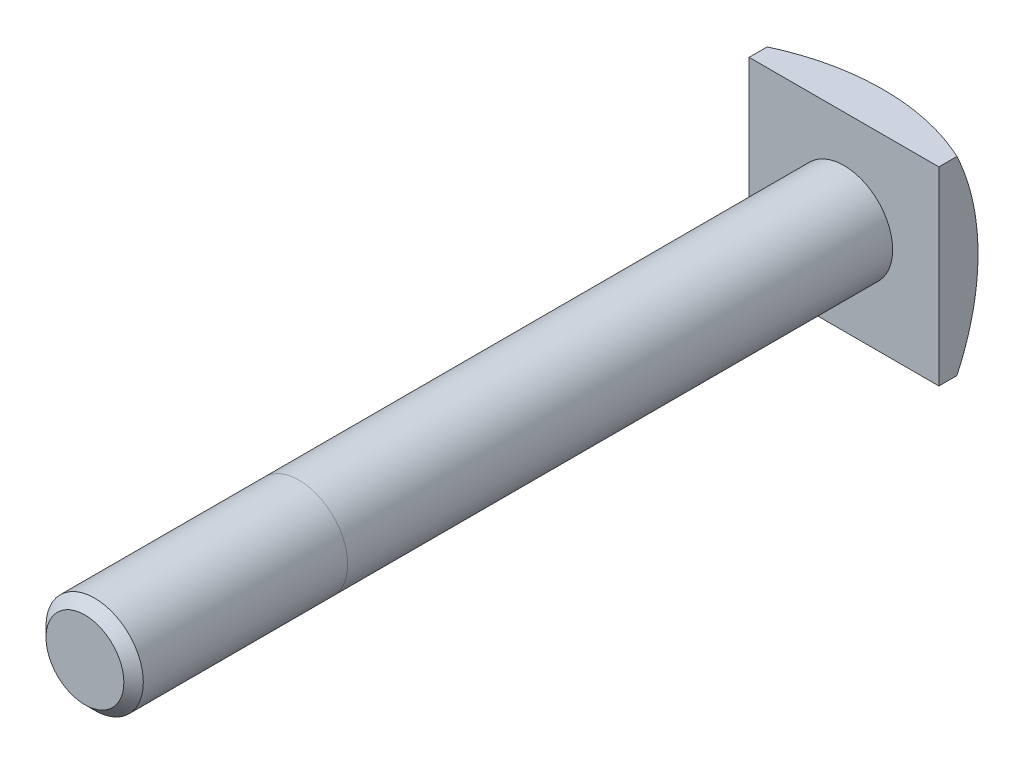
ISO-10303-21;
HEADER;
FILE_DESCRIPTION(('STEP AP214'),'2;1');
FILE_NAME('part.step','',(''),(''),'','','');
FILE_SCHEMA(('AUTOMOTIVE_DESIGN { 1 0 10303 214 1 1 1 1 }'));
ENDSEC;
DATA;
#1=APPLICATION_CONTEXT('core data for automotive mechanical design processes');
#2=APPLICATION_PROTOCOL_DEFINITION('international standard','automotive_design',2000,#1);
#3=PRODUCT_CONTEXT('',#1,'mechanical');
#4=PRODUCT('Part','Part','',(#3));
#5=PRODUCT_RELATED_PRODUCT_CATEGORY('part','',(#4));
#6=PRODUCT_DEFINITION_FORMATION('','',#4);
#7=PRODUCT_DEFINITION_CONTEXT('part definition',#1,'design');
#8=PRODUCT_DEFINITION('design','',#6,#7);
#9=PRODUCT_DEFINITION_SHAPE('','',#8);
#10=(LENGTH_UNIT() NAMED_UNIT(*) SI_UNIT(.MILLI.,.METRE.));
#11=(NAMED_UNIT(*) PLANE_ANGLE_UNIT() SI_UNIT($,.RADIAN.));
#12=(NAMED_UNIT(*) SI_UNIT($,.STERADIAN.) SOLID_ANGLE_UNIT());
#13=UNCERTAINTY_MEASURE_WITH_UNIT(LENGTH_MEASURE(1.E-05),#10,'distance_accuracy_value','');
#14=(GEOMETRIC_REPRESENTATION_CONTEXT(3) GLOBAL_UNCERTAINTY_ASSIGNED_CONTEXT((#13)) GLOBAL_UNIT_ASSIGNED_CONTEXT((#10,
#11,#12)) REPRESENTATION_CONTEXT('',''));
#15=CARTESIAN_POINT('',(0.,0.,0.));
#16=DIRECTION('',(0.,0.,1.));
#17=DIRECTION('',(1.,0.,0.));
#18=AXIS2_PLACEMENT_3D('',#15,#16,#17);
#19=CARTESIAN_POINT('',(0.,0.,84.));
#20=DIRECTION('',(0.,0.,-1.));
#21=DIRECTION('',(-1.,0.,0.));
#22=AXIS2_PLACEMENT_3D('',#19,#20,#21);
#23=CYLINDRICAL_SURFACE('',#22,5.);
#24=CARTESIAN_POINT('',(0.,0.,83.));
#25=DIRECTION('',(0.,0.,1.));
#26=DIRECTION('',(1.,0.,0.));
#27=AXIS2_PLACEMENT_3D('',#24,#25,#26);
#28=CIRCLE('',#27,5.);
#29=CARTESIAN_POINT('',(5.,0.,83.));
#30=VERTEX_POINT('',#29);
#31=EDGE_CURVE('E103',#30,#30,#28,.F.);
#32=ORIENTED_EDGE('',*,*,#31,.T.);
#33=EDGE_LOOP('',(#32));
#34=FACE_BOUND('',#33,.T.);
#35=CARTESIAN_POINT('',(0.,0.,62.));
#36=DIRECTION('',(0.,0.,-1.));
#37=DIRECTION('',(-1.,0.,0.));
#38=AXIS2_PLACEMENT_3D('',#35,#36,#37);
#39=CIRCLE('',#38,5.);
#40=CARTESIAN_POINT('',(-5.,0.,62.));
#41=VERTEX_POINT('',#40);
#42=CARTESIAN_POINT('',(5.,0.,62.));
#43=VERTEX_POINT('',#42);
#44=EDGE_CURVE('E11',#41,#43,#39,.T.);
#45=ORIENTED_EDGE('',*,*,#44,.F.);
#46=EDGE_CURVE('E50',#43,#41,#39,.T.);
#47=ORIENTED_EDGE('',*,*,#46,.F.);
#48=EDGE_LOOP('',(#45,#47));
#49=FACE_BOUND('',#48,.T.);
#50=ADVANCED_FACE('F45',(#34,#49),#23,.T.);
#51=CARTESIAN_POINT('',(9.75,9.75,6.));
#52=DIRECTION('',(-1.,0.,0.));
#53=DIRECTION('',(0.,-1.,0.));
#54=AXIS2_PLACEMENT_3D('',#51,#52,#53);
#55=PLANE('',#54);
#56=CARTESIAN_POINT('',(9.75,0.,25.));
#57=DIRECTION('',(-1.,0.,0.));
#58=DIRECTION('',(0.,-1.,0.));
#59=AXIS2_PLACEMENT_3D('',#56,#57,#58);
#60=CIRCLE('',#59,23.0203714131636);
#61=CARTESIAN_POINT('',(9.75,9.75,4.14634324632727));
#62=VERTEX_POINT('',#61);
#63=CARTESIAN_POINT('',(9.75000000000001,-9.75,4.14634324632727));
#64=VERTEX_POINT('',#63);
#65=EDGE_CURVE('E97',#62,#64,#60,.T.);
#66=ORIENTED_EDGE('',*,*,#65,.F.);
#67=DIRECTION('',(0.,0.,-1.));
#68=VECTOR('',#67,1.);
#69=CARTESIAN_POINT('',(9.75,9.75,6.));
#70=LINE('',#69,#68);
#71=CARTESIAN_POINT('',(9.75,9.75,6.));
#72=VERTEX_POINT('',#71);
#73=EDGE_CURVE('E123',#72,#62,#70,.T.);
#74=ORIENTED_EDGE('',*,*,#73,.F.);
#75=DIRECTION('',(0.,1.,0.));
#76=VECTOR('',#75,1.);
#77=CARTESIAN_POINT('',(9.75,9.75,6.));
#78=LINE('',#77,#76);
#79=CARTESIAN_POINT('',(9.75000000000001,-9.75,6.));
#80=VERTEX_POINT('',#79);
#81=EDGE_CURVE('E178',#80,#72,#78,.T.);
#82=ORIENTED_EDGE('',*,*,#81,.F.);
#83=DIRECTION('',(0.,0.,-1.));
#84=VECTOR('',#83,1.);
#85=CARTESIAN_POINT('',(9.75000000000001,-9.75,6.));
#86=LINE('',#85,#84);
#87=EDGE_CURVE('E119',#80,#64,#86,.T.);
#88=ORIENTED_EDGE('',*,*,#87,.T.);
#89=EDGE_LOOP('',(#66,#74,#82,#88));
#90=FACE_BOUND('',#89,.T.);
#91=ADVANCED_FACE('F156',(#90),#55,.F.);
#92=CARTESIAN_POINT('',(-9.75,9.75,6.));
#93=DIRECTION('',(0.,-1.,0.));
#94=DIRECTION('',(0.,0.,-1.));
#95=AXIS2_PLACEMENT_3D('',#92,#93,#94);
#96=PLANE('',#95);
#97=CARTESIAN_POINT('',(0.,9.75,25.));
#98=DIRECTION('',(0.,-1.,0.));
#99=DIRECTION('',(0.,0.,-1.));
#100=AXIS2_PLACEMENT_3D('',#97,#98,#99);
#101=CIRCLE('',#100,23.0203714131636);
#102=CARTESIAN_POINT('',(-9.75,9.75,4.14634324632727));
#103=VERTEX_POINT('',#102);
#104=EDGE_CURVE('E114',#103,#62,#101,.T.);
#105=ORIENTED_EDGE('',*,*,#104,.F.);
#106=DIRECTION('',(0.,0.,-1.));
#107=VECTOR('',#106,1.);
#108=CARTESIAN_POINT('',(-9.75,9.75,6.));
#109=LINE('',#108,#107);
#110=CARTESIAN_POINT('',(-9.75,9.75,6.));
#111=VERTEX_POINT('',#110);
#112=EDGE_CURVE('E112',#111,#103,#109,.T.);
#113=ORIENTED_EDGE('',*,*,#112,.F.);
#114=DIRECTION('',(-1.,0.,0.));
#115=VECTOR('',#114,1.);
#116=CARTESIAN_POINT('',(-9.75,9.75,6.));
#117=LINE('',#116,#115);
#118=EDGE_CURVE('E187',#72,#111,#117,.T.);
#119=ORIENTED_EDGE('',*,*,#118,.F.);
#120=ORIENTED_EDGE('',*,*,#73,.T.);
#121=EDGE_LOOP('',(#105,#113,#119,#120));
#122=FACE_BOUND('',#121,.T.);
#123=ADVANCED_FACE('F160',(#122),#96,.F.);
#124=CARTESIAN_POINT('',(-9.75,9.75,6.));
#125=DIRECTION('',(1.,0.,0.));
#126=DIRECTION('',(0.,1.,0.));
#127=AXIS2_PLACEMENT_3D('',#124,#125,#126);
#128=PLANE('',#127);
#129=CARTESIAN_POINT('',(-9.75,0.,25.));
#130=DIRECTION('',(1.,0.,0.));
#131=DIRECTION('',(0.,1.,0.));
#132=AXIS2_PLACEMENT_3D('',#129,#130,#131);
#133=CIRCLE('',#132,23.0203714131636);
#134=CARTESIAN_POINT('',(-9.74999999999999,-9.75,4.14634324632727));
#135=VERTEX_POINT('',#134);
#136=EDGE_CURVE('E94',#135,#103,#133,.T.);
#137=ORIENTED_EDGE('',*,*,#136,.F.);
#138=DIRECTION('',(0.,0.,-1.));
#139=VECTOR('',#138,1.);
#140=CARTESIAN_POINT('',(-9.74999999999999,-9.75,6.));
#141=LINE('',#140,#139);
#142=CARTESIAN_POINT('',(-9.74999999999999,-9.75,6.));
#143=VERTEX_POINT('',#142);
#144=EDGE_CURVE('E109',#143,#135,#141,.T.);
#145=ORIENTED_EDGE('',*,*,#144,.F.);
#146=DIRECTION('',(0.,-1.,0.));
#147=VECTOR('',#146,1.);
#148=CARTESIAN_POINT('',(-9.75,9.75,6.));
#149=LINE('',#148,#147);
#150=EDGE_CURVE('E190',#111,#143,#149,.T.);
#151=ORIENTED_EDGE('',*,*,#150,.F.);
#152=ORIENTED_EDGE('',*,*,#112,.T.);
#153=EDGE_LOOP('',(#137,#145,#151,#152));
#154=FACE_BOUND('',#153,.T.);
#155=ADVANCED_FACE('F107',(#154),#128,.F.);
#156=CARTESIAN_POINT('',(-9.74999999999999,-9.75,6.));
#157=DIRECTION('',(0.,1.,0.));
#158=DIRECTION('',(0.,0.,1.));
#159=AXIS2_PLACEMENT_3D('',#156,#157,#158);
#160=PLANE('',#159);
#161=CARTESIAN_POINT('',(0.,-9.75,25.));
#162=DIRECTION('',(0.,1.,0.));
#163=DIRECTION('',(0.,0.,1.));
#164=AXIS2_PLACEMENT_3D('',#161,#162,#163);
#165=CIRCLE('',#164,23.0203714131636);
#166=EDGE_CURVE('E91',#64,#135,#165,.T.);
#167=ORIENTED_EDGE('',*,*,#166,.F.);
#168=ORIENTED_EDGE('',*,*,#87,.F.);
#169=DIRECTION('',(1.,0.,0.));
#170=VECTOR('',#169,1.);
#171=CARTESIAN_POINT('',(-9.74999999999999,-9.75,6.));
#172=LINE('',#171,#170);
#173=EDGE_CURVE('E117',#143,#80,#172,.T.);
#174=ORIENTED_EDGE('',*,*,#173,.F.);
#175=ORIENTED_EDGE('',*,*,#144,.T.);
#176=EDGE_LOOP('',(#167,#168,#174,#175));
#177=FACE_BOUND('',#176,.T.);
#178=ADVANCED_FACE('F116',(#177),#160,.F.);
#179=CARTESIAN_POINT('',(0.,0.,6.));
#180=DIRECTION('',(0.,0.,1.));
#181=DIRECTION('',(1.,0.,0.));
#182=AXIS2_PLACEMENT_3D('',#179,#180,#181);
#183=PLANE('',#182);
#184=CARTESIAN_POINT('',(0.,0.,6.));
#185=DIRECTION('',(0.,0.,1.));
#186=DIRECTION('',(1.,0.,0.));
#187=AXIS2_PLACEMENT_3D('',#184,#185,#186);
#188=CIRCLE('',#187,5.);
#189=CARTESIAN_POINT('',(5.,0.,6.));
#190=VERTEX_POINT('',#189);
#191=EDGE_CURVE('E131',#190,#190,#188,.T.);
#192=ORIENTED_EDGE('',*,*,#191,.F.);
#193=EDGE_LOOP('',(#192));
#194=FACE_BOUND('',#193,.T.);
#195=ORIENTED_EDGE('',*,*,#81,.T.);
#196=ORIENTED_EDGE('',*,*,#118,.T.);
#197=ORIENTED_EDGE('',*,*,#150,.T.);
#198=ORIENTED_EDGE('',*,*,#173,.T.);
#199=EDGE_LOOP('',(#195,#196,#197,#198));
#200=FACE_BOUND('',#199,.T.);
#201=ADVANCED_FACE('F152',(#194,#200),#183,.T.);
#202=ORIENTED_EDGE('',*,*,#46,.T.);
#203=ORIENTED_EDGE('',*,*,#44,.T.);
#204=EDGE_LOOP('',(#202,#203));
#205=FACE_BOUND('',#204,.T.);
#206=ORIENTED_EDGE('',*,*,#191,.T.);
#207=EDGE_LOOP('',(#206));
#208=FACE_BOUND('',#207,.T.);
#209=ADVANCED_FACE('F147',(#205,#208),#23,.T.);
#210=CARTESIAN_POINT('',(0.,0.,84.));
#211=DIRECTION('',(0.,0.,1.));
#212=DIRECTION('',(1.,0.,0.));
#213=AXIS2_PLACEMENT_3D('',#210,#211,#212);
#214=PLANE('',#213);
#215=CARTESIAN_POINT('',(0.,0.,84.));
#216=DIRECTION('',(0.,0.,1.));
#217=DIRECTION('',(1.,0.,0.));
#218=AXIS2_PLACEMENT_3D('',#215,#216,#217);
#219=CIRCLE('',#218,3.99999999999999);
#220=CARTESIAN_POINT('',(3.99999999999999,0.,84.));
#221=VERTEX_POINT('',#220);
#222=EDGE_CURVE('E132',#221,#221,#219,.T.);
#223=ORIENTED_EDGE('',*,*,#222,.T.);
#224=EDGE_LOOP('',(#223));
#225=FACE_BOUND('',#224,.T.);
#226=ADVANCED_FACE('F143',(#225),#214,.T.);
#227=CARTESIAN_POINT('',(0.,0.,84.));
#228=DIRECTION('',(0.,0.,-1.));
#229=DIRECTION('',(-1.,0.,0.));
#230=AXIS2_PLACEMENT_3D('',#227,#228,#229);
#231=CONICAL_SURFACE('',#230,3.99999999999999,0.785398163397439);
#232=ORIENTED_EDGE('',*,*,#31,.F.);
#233=EDGE_LOOP('',(#232));
#234=FACE_BOUND('',#233,.T.);
#235=ORIENTED_EDGE('',*,*,#222,.F.);
#236=EDGE_LOOP('',(#235));
#237=FACE_BOUND('',#236,.T.);
#238=ADVANCED_FACE('F48',(#234,#237),#231,.T.);
#239=CARTESIAN_POINT('',(0.,0.,25.));
#240=DIRECTION('',(0.,0.,-1.));
#241=DIRECTION('',(-1.,0.,0.));
#242=AXIS2_PLACEMENT_3D('',#239,#240,#241);
#243=SPHERICAL_SURFACE('',#242,25.);
#244=CARTESIAN_POINT('',(0.,0.,0.));
#245=VERTEX_POINT('',#244);
#246=VERTEX_LOOP('',#245);
#247=FACE_BOUND('',#246,.T.);
#248=ORIENTED_EDGE('',*,*,#65,.T.);
#249=ORIENTED_EDGE('',*,*,#166,.T.);
#250=ORIENTED_EDGE('',*,*,#136,.T.);
#251=ORIENTED_EDGE('',*,*,#104,.T.);
#252=EDGE_LOOP('',(#248,#249,#250,#251));
#253=FACE_BOUND('',#252,.T.);
#254=ADVANCED_FACE('F93',(#247,#253),#243,.T.);
#255=CLOSED_SHELL('',(#50,#91,#123,#155,#178,#201,#209,#226,#238,#254));
#256=MANIFOLD_SOLID_BREP('B2',#255);
#257=ADVANCED_BREP_SHAPE_REPRESENTATION('',(#18,#256),#14);
#258=SHAPE_DEFINITION_REPRESENTATION(#9,#257);
ENDSEC;
END-ISO-10303-21;
